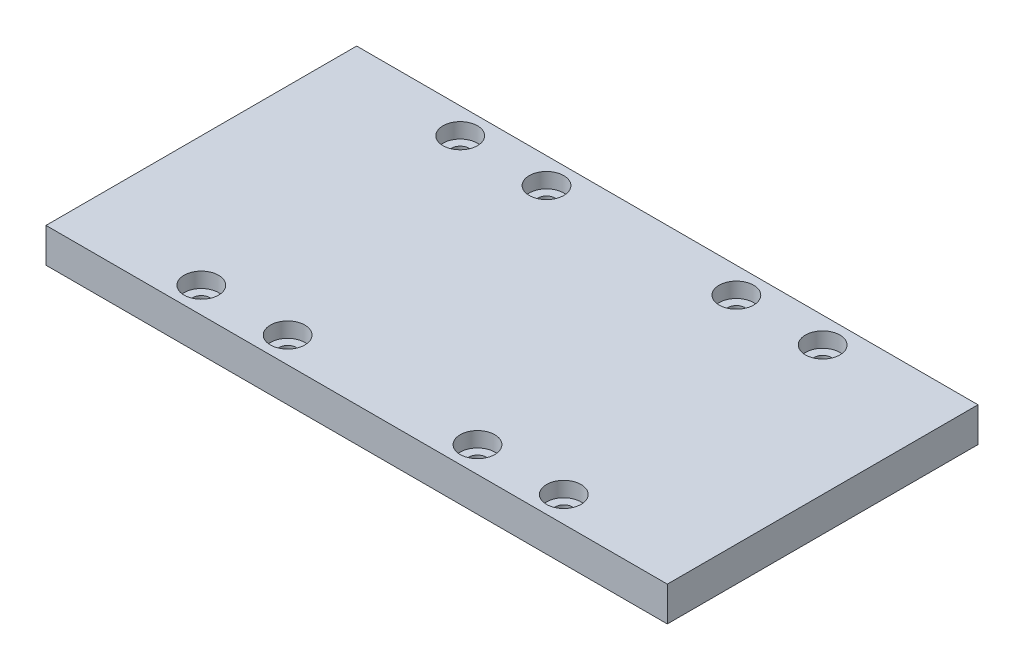
ISO-10303-21;
HEADER;
FILE_DESCRIPTION(('STEP AP214'),'2;1');
FILE_NAME('part.step','',(''),(''),'','','');
FILE_SCHEMA(('AUTOMOTIVE_DESIGN { 1 0 10303 214 1 1 1 1 }'));
ENDSEC;
DATA;
#1=APPLICATION_CONTEXT('core data for automotive mechanical design processes');
#2=APPLICATION_PROTOCOL_DEFINITION('international standard','automotive_design',2000,#1);
#3=PRODUCT_CONTEXT('',#1,'mechanical');
#4=PRODUCT('Part','Part','',(#3));
#5=PRODUCT_RELATED_PRODUCT_CATEGORY('part','',(#4));
#6=PRODUCT_DEFINITION_FORMATION('','',#4);
#7=PRODUCT_DEFINITION_CONTEXT('part definition',#1,'design');
#8=PRODUCT_DEFINITION('design','',#6,#7);
#9=PRODUCT_DEFINITION_SHAPE('','',#8);
#10=(LENGTH_UNIT() NAMED_UNIT(*) SI_UNIT(.MILLI.,.METRE.));
#11=(NAMED_UNIT(*) PLANE_ANGLE_UNIT() SI_UNIT($,.RADIAN.));
#12=(NAMED_UNIT(*) SI_UNIT($,.STERADIAN.) SOLID_ANGLE_UNIT());
#13=UNCERTAINTY_MEASURE_WITH_UNIT(LENGTH_MEASURE(1.E-05),#10,'distance_accuracy_value','');
#14=(GEOMETRIC_REPRESENTATION_CONTEXT(3) GLOBAL_UNCERTAINTY_ASSIGNED_CONTEXT((#13)) GLOBAL_UNIT_ASSIGNED_CONTEXT((#10,
#11,#12)) REPRESENTATION_CONTEXT('',''));
#15=CARTESIAN_POINT('',(0.,0.,0.));
#16=DIRECTION('',(0.,0.,1.));
#17=DIRECTION('',(1.,0.,0.));
#18=AXIS2_PLACEMENT_3D('',#15,#16,#17);
#19=CARTESIAN_POINT('',(180.975,311.912,-9.525));
#20=DIRECTION('',(0.,-1.,0.));
#21=DIRECTION('',(0.,0.,-1.));
#22=AXIS2_PLACEMENT_3D('',#19,#20,#21);
#23=CYLINDRICAL_SURFACE('',#22,3.175);
#24=CARTESIAN_POINT('',(180.975,0.,-9.525));
#25=DIRECTION('',(0.,-1.,0.));
#26=DIRECTION('',(0.,0.,-1.));
#27=AXIS2_PLACEMENT_3D('',#24,#25,#26);
#28=CIRCLE('',#27,3.175);
#29=CARTESIAN_POINT('',(180.975,0.,-12.7));
#30=VERTEX_POINT('',#29);
#31=EDGE_CURVE('E188',#30,#30,#28,.T.);
#32=ORIENTED_EDGE('',*,*,#31,.T.);
#33=EDGE_LOOP('',(#32));
#34=FACE_BOUND('',#33,.T.);
#35=CARTESIAN_POINT('',(180.975,7.14375,-9.525));
#36=DIRECTION('',(0.,1.,0.));
#37=DIRECTION('',(0.,0.,1.));
#38=AXIS2_PLACEMENT_3D('',#35,#36,#37);
#39=CIRCLE('',#38,3.175);
#40=CARTESIAN_POINT('',(180.975,7.14375,-6.35));
#41=VERTEX_POINT('',#40);
#42=EDGE_CURVE('E35',#41,#41,#39,.F.);
#43=ORIENTED_EDGE('',*,*,#42,.F.);
#44=EDGE_LOOP('',(#43));
#45=FACE_BOUND('',#44,.T.);
#46=ADVANCED_FACE('F31',(#34,#45),#23,.F.);
#47=CARTESIAN_POINT('',(149.225,311.912,-9.525));
#48=DIRECTION('',(0.,-1.,0.));
#49=DIRECTION('',(0.,0.,-1.));
#50=AXIS2_PLACEMENT_3D('',#47,#48,#49);
#51=CYLINDRICAL_SURFACE('',#50,3.175);
#52=CARTESIAN_POINT('',(149.225,0.,-9.525));
#53=DIRECTION('',(0.,-1.,0.));
#54=DIRECTION('',(0.,0.,-1.));
#55=AXIS2_PLACEMENT_3D('',#52,#53,#54);
#56=CIRCLE('',#55,3.175);
#57=CARTESIAN_POINT('',(149.225,0.,-12.7));
#58=VERTEX_POINT('',#57);
#59=EDGE_CURVE('E191',#58,#58,#56,.T.);
#60=ORIENTED_EDGE('',*,*,#59,.T.);
#61=EDGE_LOOP('',(#60));
#62=FACE_BOUND('',#61,.T.);
#63=CARTESIAN_POINT('',(149.225,7.14375,-9.525));
#64=DIRECTION('',(0.,1.,0.));
#65=DIRECTION('',(0.,0.,1.));
#66=AXIS2_PLACEMENT_3D('',#63,#64,#65);
#67=CIRCLE('',#66,3.175);
#68=CARTESIAN_POINT('',(149.225,7.14375,-6.35));
#69=VERTEX_POINT('',#68);
#70=EDGE_CURVE('E136',#69,#69,#67,.F.);
#71=ORIENTED_EDGE('',*,*,#70,.F.);
#72=EDGE_LOOP('',(#71));
#73=FACE_BOUND('',#72,.T.);
#74=ADVANCED_FACE('F222',(#62,#73),#51,.F.);
#75=CARTESIAN_POINT('',(79.375,311.912,-9.525));
#76=DIRECTION('',(0.,-1.,0.));
#77=DIRECTION('',(0.,0.,-1.));
#78=AXIS2_PLACEMENT_3D('',#75,#76,#77);
#79=CYLINDRICAL_SURFACE('',#78,3.175);
#80=CARTESIAN_POINT('',(79.375,0.,-9.525));
#81=DIRECTION('',(0.,-1.,0.));
#82=DIRECTION('',(0.,0.,-1.));
#83=AXIS2_PLACEMENT_3D('',#80,#81,#82);
#84=CIRCLE('',#83,3.175);
#85=CARTESIAN_POINT('',(79.375,0.,-12.7));
#86=VERTEX_POINT('',#85);
#87=EDGE_CURVE('E194',#86,#86,#84,.T.);
#88=ORIENTED_EDGE('',*,*,#87,.T.);
#89=EDGE_LOOP('',(#88));
#90=FACE_BOUND('',#89,.T.);
#91=CARTESIAN_POINT('',(79.375,7.14375,-9.525));
#92=DIRECTION('',(0.,1.,0.));
#93=DIRECTION('',(0.,0.,1.));
#94=AXIS2_PLACEMENT_3D('',#91,#92,#93);
#95=CIRCLE('',#94,3.175);
#96=CARTESIAN_POINT('',(79.375,7.14375,-6.35));
#97=VERTEX_POINT('',#96);
#98=EDGE_CURVE('E132',#97,#97,#95,.F.);
#99=ORIENTED_EDGE('',*,*,#98,.F.);
#100=EDGE_LOOP('',(#99));
#101=FACE_BOUND('',#100,.T.);
#102=ADVANCED_FACE('F228',(#90,#101),#79,.F.);
#103=CARTESIAN_POINT('',(47.625,311.912,-9.525));
#104=DIRECTION('',(0.,-1.,0.));
#105=DIRECTION('',(0.,0.,-1.));
#106=AXIS2_PLACEMENT_3D('',#103,#104,#105);
#107=CYLINDRICAL_SURFACE('',#106,3.175);
#108=CARTESIAN_POINT('',(47.625,0.,-9.525));
#109=DIRECTION('',(0.,-1.,0.));
#110=DIRECTION('',(0.,0.,-1.));
#111=AXIS2_PLACEMENT_3D('',#108,#109,#110);
#112=CIRCLE('',#111,3.175);
#113=CARTESIAN_POINT('',(47.625,0.,-12.7));
#114=VERTEX_POINT('',#113);
#115=EDGE_CURVE('E101',#114,#114,#112,.T.);
#116=ORIENTED_EDGE('',*,*,#115,.T.);
#117=EDGE_LOOP('',(#116));
#118=FACE_BOUND('',#117,.T.);
#119=CARTESIAN_POINT('',(47.625,7.14375,-9.525));
#120=DIRECTION('',(0.,1.,0.));
#121=DIRECTION('',(0.,0.,1.));
#122=AXIS2_PLACEMENT_3D('',#119,#120,#121);
#123=CIRCLE('',#122,3.175);
#124=CARTESIAN_POINT('',(47.625,7.14375,-6.35));
#125=VERTEX_POINT('',#124);
#126=EDGE_CURVE('E127',#125,#125,#123,.F.);
#127=ORIENTED_EDGE('',*,*,#126,.F.);
#128=EDGE_LOOP('',(#127));
#129=FACE_BOUND('',#128,.T.);
#130=ADVANCED_FACE('F200',(#118,#129),#107,.F.);
#131=CARTESIAN_POINT('',(180.975000000001,311.912,-104.775));
#132=DIRECTION('',(0.,-1.,0.));
#133=DIRECTION('',(0.,0.,-1.));
#134=AXIS2_PLACEMENT_3D('',#131,#132,#133);
#135=CYLINDRICAL_SURFACE('',#134,3.175);
#136=CARTESIAN_POINT('',(180.975000000001,0.,-104.775));
#137=DIRECTION('',(0.,-1.,0.));
#138=DIRECTION('',(0.,0.,-1.));
#139=AXIS2_PLACEMENT_3D('',#136,#137,#138);
#140=CIRCLE('',#139,3.175);
#141=CARTESIAN_POINT('',(180.975000000001,0.,-107.95));
#142=VERTEX_POINT('',#141);
#143=EDGE_CURVE('E110',#142,#142,#140,.T.);
#144=ORIENTED_EDGE('',*,*,#143,.T.);
#145=EDGE_LOOP('',(#144));
#146=FACE_BOUND('',#145,.T.);
#147=CARTESIAN_POINT('',(180.975000000001,7.14375,-104.775));
#148=DIRECTION('',(0.,1.,0.));
#149=DIRECTION('',(0.,0.,1.));
#150=AXIS2_PLACEMENT_3D('',#147,#148,#149);
#151=CIRCLE('',#150,3.175);
#152=CARTESIAN_POINT('',(180.975000000001,7.14375,-101.6));
#153=VERTEX_POINT('',#152);
#154=EDGE_CURVE('E122',#153,#153,#151,.F.);
#155=ORIENTED_EDGE('',*,*,#154,.F.);
#156=EDGE_LOOP('',(#155));
#157=FACE_BOUND('',#156,.T.);
#158=ADVANCED_FACE('F240',(#146,#157),#135,.F.);
#159=CARTESIAN_POINT('',(149.225000000001,311.912,-104.775));
#160=DIRECTION('',(0.,-1.,0.));
#161=DIRECTION('',(0.,0.,-1.));
#162=AXIS2_PLACEMENT_3D('',#159,#160,#161);
#163=CYLINDRICAL_SURFACE('',#162,3.175);
#164=CARTESIAN_POINT('',(149.225000000001,0.,-104.775));
#165=DIRECTION('',(0.,-1.,0.));
#166=DIRECTION('',(0.,0.,-1.));
#167=AXIS2_PLACEMENT_3D('',#164,#165,#166);
#168=CIRCLE('',#167,3.175);
#169=CARTESIAN_POINT('',(149.225000000001,0.,-107.95));
#170=VERTEX_POINT('',#169);
#171=EDGE_CURVE('E179',#170,#170,#168,.T.);
#172=ORIENTED_EDGE('',*,*,#171,.T.);
#173=EDGE_LOOP('',(#172));
#174=FACE_BOUND('',#173,.T.);
#175=CARTESIAN_POINT('',(149.225000000001,7.14375,-104.775));
#176=DIRECTION('',(0.,1.,0.));
#177=DIRECTION('',(0.,0.,1.));
#178=AXIS2_PLACEMENT_3D('',#175,#176,#177);
#179=CIRCLE('',#178,3.175);
#180=CARTESIAN_POINT('',(149.225000000001,7.14375,-101.6));
#181=VERTEX_POINT('',#180);
#182=EDGE_CURVE('E117',#181,#181,#179,.F.);
#183=ORIENTED_EDGE('',*,*,#182,.F.);
#184=EDGE_LOOP('',(#183));
#185=FACE_BOUND('',#184,.T.);
#186=ADVANCED_FACE('F244',(#174,#185),#163,.F.);
#187=CARTESIAN_POINT('',(79.375000000001,311.912,-104.775));
#188=DIRECTION('',(0.,-1.,0.));
#189=DIRECTION('',(0.,0.,-1.));
#190=AXIS2_PLACEMENT_3D('',#187,#188,#189);
#191=CYLINDRICAL_SURFACE('',#190,3.175);
#192=CARTESIAN_POINT('',(79.375000000001,0.,-104.775));
#193=DIRECTION('',(0.,-1.,0.));
#194=DIRECTION('',(0.,0.,-1.));
#195=AXIS2_PLACEMENT_3D('',#192,#193,#194);
#196=CIRCLE('',#195,3.175);
#197=CARTESIAN_POINT('',(79.375000000001,0.,-107.95));
#198=VERTEX_POINT('',#197);
#199=EDGE_CURVE('E182',#198,#198,#196,.T.);
#200=ORIENTED_EDGE('',*,*,#199,.T.);
#201=EDGE_LOOP('',(#200));
#202=FACE_BOUND('',#201,.T.);
#203=CARTESIAN_POINT('',(79.375000000001,7.14375,-104.775));
#204=DIRECTION('',(0.,1.,0.));
#205=DIRECTION('',(0.,0.,1.));
#206=AXIS2_PLACEMENT_3D('',#203,#204,#205);
#207=CIRCLE('',#206,3.175);
#208=CARTESIAN_POINT('',(79.375000000001,7.14375,-101.6));
#209=VERTEX_POINT('',#208);
#210=EDGE_CURVE('E112',#209,#209,#207,.F.);
#211=ORIENTED_EDGE('',*,*,#210,.F.);
#212=EDGE_LOOP('',(#211));
#213=FACE_BOUND('',#212,.T.);
#214=ADVANCED_FACE('F250',(#202,#213),#191,.F.);
#215=CARTESIAN_POINT('',(47.625000000001,311.912,-104.775));
#216=DIRECTION('',(0.,-1.,0.));
#217=DIRECTION('',(0.,0.,-1.));
#218=AXIS2_PLACEMENT_3D('',#215,#216,#217);
#219=CYLINDRICAL_SURFACE('',#218,3.175);
#220=CARTESIAN_POINT('',(47.625000000001,0.,-104.775));
#221=DIRECTION('',(0.,-1.,0.));
#222=DIRECTION('',(0.,0.,-1.));
#223=AXIS2_PLACEMENT_3D('',#220,#221,#222);
#224=CIRCLE('',#223,3.175);
#225=CARTESIAN_POINT('',(47.625000000001,0.,-107.95));
#226=VERTEX_POINT('',#225);
#227=EDGE_CURVE('E185',#226,#226,#224,.T.);
#228=ORIENTED_EDGE('',*,*,#227,.T.);
#229=EDGE_LOOP('',(#228));
#230=FACE_BOUND('',#229,.T.);
#231=CARTESIAN_POINT('',(47.625000000001,7.14375,-104.775));
#232=DIRECTION('',(0.,1.,0.));
#233=DIRECTION('',(0.,0.,1.));
#234=AXIS2_PLACEMENT_3D('',#231,#232,#233);
#235=CIRCLE('',#234,3.175);
#236=CARTESIAN_POINT('',(47.625000000001,7.14375,-101.6));
#237=VERTEX_POINT('',#236);
#238=EDGE_CURVE('E107',#237,#237,#235,.F.);
#239=ORIENTED_EDGE('',*,*,#238,.F.);
#240=EDGE_LOOP('',(#239));
#241=FACE_BOUND('',#240,.T.);
#242=ADVANCED_FACE('F233',(#230,#241),#219,.F.);
#243=CARTESIAN_POINT('',(0.,12.7,0.));
#244=DIRECTION('',(1.,0.,0.));
#245=DIRECTION('',(0.,0.,-1.));
#246=AXIS2_PLACEMENT_3D('',#243,#244,#245);
#247=PLANE('',#246);
#248=DIRECTION('',(0.,0.,1.));
#249=VECTOR('',#248,1.);
#250=CARTESIAN_POINT('',(0.,0.,0.));
#251=LINE('',#250,#249);
#252=CARTESIAN_POINT('',(0.,0.,-114.3));
#253=VERTEX_POINT('',#252);
#254=CARTESIAN_POINT('',(0.,0.,0.));
#255=VERTEX_POINT('',#254);
#256=EDGE_CURVE('E98',#253,#255,#251,.T.);
#257=ORIENTED_EDGE('',*,*,#256,.T.);
#258=DIRECTION('',(0.,-1.,0.));
#259=VECTOR('',#258,1.);
#260=CARTESIAN_POINT('',(0.,12.7,0.));
#261=LINE('',#260,#259);
#262=CARTESIAN_POINT('',(0.,12.7,0.));
#263=VERTEX_POINT('',#262);
#264=EDGE_CURVE('E11',#263,#255,#261,.T.);
#265=ORIENTED_EDGE('',*,*,#264,.F.);
#266=DIRECTION('',(0.,0.,1.));
#267=VECTOR('',#266,1.);
#268=CARTESIAN_POINT('',(0.,12.7,0.));
#269=LINE('',#268,#267);
#270=CARTESIAN_POINT('',(0.,12.7,-114.3));
#271=VERTEX_POINT('',#270);
#272=EDGE_CURVE('E85',#271,#263,#269,.T.);
#273=ORIENTED_EDGE('',*,*,#272,.F.);
#274=DIRECTION('',(0.,-1.,0.));
#275=VECTOR('',#274,1.);
#276=CARTESIAN_POINT('',(0.,12.7,-114.3));
#277=LINE('',#276,#275);
#278=EDGE_CURVE('E94',#271,#253,#277,.T.);
#279=ORIENTED_EDGE('',*,*,#278,.T.);
#280=EDGE_LOOP('',(#257,#265,#273,#279));
#281=FACE_BOUND('',#280,.T.);
#282=ADVANCED_FACE('F33',(#281),#247,.F.);
#283=CARTESIAN_POINT('',(0.,12.7,0.));
#284=DIRECTION('',(0.,0.,-1.));
#285=DIRECTION('',(-1.,0.,0.));
#286=AXIS2_PLACEMENT_3D('',#283,#284,#285);
#287=PLANE('',#286);
#288=DIRECTION('',(1.,0.,0.));
#289=VECTOR('',#288,1.);
#290=CARTESIAN_POINT('',(0.,0.,0.));
#291=LINE('',#290,#289);
#292=CARTESIAN_POINT('',(228.6,0.,0.));
#293=VERTEX_POINT('',#292);
#294=EDGE_CURVE('E89',#255,#293,#291,.T.);
#295=ORIENTED_EDGE('',*,*,#294,.T.);
#296=DIRECTION('',(0.,-1.,0.));
#297=VECTOR('',#296,1.);
#298=CARTESIAN_POINT('',(228.6,12.7,0.));
#299=LINE('',#298,#297);
#300=CARTESIAN_POINT('',(228.6,12.7,0.));
#301=VERTEX_POINT('',#300);
#302=EDGE_CURVE('E41',#301,#293,#299,.T.);
#303=ORIENTED_EDGE('',*,*,#302,.F.);
#304=DIRECTION('',(1.,0.,0.));
#305=VECTOR('',#304,1.);
#306=CARTESIAN_POINT('',(0.,12.7,0.));
#307=LINE('',#306,#305);
#308=EDGE_CURVE('E80',#263,#301,#307,.T.);
#309=ORIENTED_EDGE('',*,*,#308,.F.);
#310=ORIENTED_EDGE('',*,*,#264,.T.);
#311=EDGE_LOOP('',(#295,#303,#309,#310));
#312=FACE_BOUND('',#311,.T.);
#313=ADVANCED_FACE('F88',(#312),#287,.F.);
#314=CARTESIAN_POINT('',(228.6,12.7,0.));
#315=DIRECTION('',(-1.,0.,0.));
#316=DIRECTION('',(0.,0.,1.));
#317=AXIS2_PLACEMENT_3D('',#314,#315,#316);
#318=PLANE('',#317);
#319=DIRECTION('',(0.,0.,-1.));
#320=VECTOR('',#319,1.);
#321=CARTESIAN_POINT('',(228.6,0.,0.));
#322=LINE('',#321,#320);
#323=CARTESIAN_POINT('',(228.6,0.,-114.3));
#324=VERTEX_POINT('',#323);
#325=EDGE_CURVE('E67',#293,#324,#322,.T.);
#326=ORIENTED_EDGE('',*,*,#325,.T.);
#327=DIRECTION('',(0.,-1.,0.));
#328=VECTOR('',#327,1.);
#329=CARTESIAN_POINT('',(228.6,12.7,-114.3));
#330=LINE('',#329,#328);
#331=CARTESIAN_POINT('',(228.6,12.7,-114.3));
#332=VERTEX_POINT('',#331);
#333=EDGE_CURVE('E90',#332,#324,#330,.T.);
#334=ORIENTED_EDGE('',*,*,#333,.F.);
#335=DIRECTION('',(0.,0.,-1.));
#336=VECTOR('',#335,1.);
#337=CARTESIAN_POINT('',(228.6,12.7,0.));
#338=LINE('',#337,#336);
#339=EDGE_CURVE('E83',#301,#332,#338,.T.);
#340=ORIENTED_EDGE('',*,*,#339,.F.);
#341=ORIENTED_EDGE('',*,*,#302,.T.);
#342=EDGE_LOOP('',(#326,#334,#340,#341));
#343=FACE_BOUND('',#342,.T.);
#344=ADVANCED_FACE('F92',(#343),#318,.F.);
#345=CARTESIAN_POINT('',(0.,12.7,-114.3));
#346=DIRECTION('',(0.,0.,1.));
#347=DIRECTION('',(1.,0.,0.));
#348=AXIS2_PLACEMENT_3D('',#345,#346,#347);
#349=PLANE('',#348);
#350=DIRECTION('',(-1.,0.,0.));
#351=VECTOR('',#350,1.);
#352=CARTESIAN_POINT('',(0.,0.,-114.3));
#353=LINE('',#352,#351);
#354=EDGE_CURVE('E73',#324,#253,#353,.T.);
#355=ORIENTED_EDGE('',*,*,#354,.T.);
#356=ORIENTED_EDGE('',*,*,#278,.F.);
#357=DIRECTION('',(-1.,0.,0.));
#358=VECTOR('',#357,1.);
#359=CARTESIAN_POINT('',(0.,12.7,-114.3));
#360=LINE('',#359,#358);
#361=EDGE_CURVE('E50',#332,#271,#360,.T.);
#362=ORIENTED_EDGE('',*,*,#361,.F.);
#363=ORIENTED_EDGE('',*,*,#333,.T.);
#364=EDGE_LOOP('',(#355,#356,#362,#363));
#365=FACE_BOUND('',#364,.T.);
#366=ADVANCED_FACE('F211',(#365),#349,.F.);
#367=CARTESIAN_POINT('',(0.,12.7,-114.3));
#368=DIRECTION('',(0.,-1.,0.));
#369=DIRECTION('',(0.,0.,-1.));
#370=AXIS2_PLACEMENT_3D('',#367,#368,#369);
#371=PLANE('',#370);
#372=CARTESIAN_POINT('',(180.975000000002,12.7,-9.52500000000001));
#373=DIRECTION('',(0.,1.,0.));
#374=DIRECTION('',(0.,0.,1.));
#375=AXIS2_PLACEMENT_3D('',#372,#373,#374);
#376=CIRCLE('',#375,6.35000000000101);
#377=CARTESIAN_POINT('',(180.975000000002,12.7,-3.17499999999899));
#378=VERTEX_POINT('',#377);
#379=EDGE_CURVE('E152',#378,#378,#376,.T.);
#380=ORIENTED_EDGE('',*,*,#379,.F.);
#381=EDGE_LOOP('',(#380));
#382=FACE_BOUND('',#381,.T.);
#383=CARTESIAN_POINT('',(149.225000000002,12.7,-9.52500000000001));
#384=DIRECTION('',(0.,1.,0.));
#385=DIRECTION('',(0.,0.,1.));
#386=AXIS2_PLACEMENT_3D('',#383,#384,#385);
#387=CIRCLE('',#386,6.35000000000099);
#388=CARTESIAN_POINT('',(149.225000000002,12.7,-3.17499999999902));
#389=VERTEX_POINT('',#388);
#390=EDGE_CURVE('E145',#389,#389,#387,.T.);
#391=ORIENTED_EDGE('',*,*,#390,.F.);
#392=EDGE_LOOP('',(#391));
#393=FACE_BOUND('',#392,.T.);
#394=CARTESIAN_POINT('',(79.375000000002,12.7,-9.52500000000001));
#395=DIRECTION('',(0.,1.,0.));
#396=DIRECTION('',(0.,0.,1.));
#397=AXIS2_PLACEMENT_3D('',#394,#395,#396);
#398=CIRCLE('',#397,6.35000000000101);
#399=CARTESIAN_POINT('',(79.375000000002,12.7,-3.17499999999899));
#400=VERTEX_POINT('',#399);
#401=EDGE_CURVE('E138',#400,#400,#398,.T.);
#402=ORIENTED_EDGE('',*,*,#401,.F.);
#403=EDGE_LOOP('',(#402));
#404=FACE_BOUND('',#403,.T.);
#405=CARTESIAN_POINT('',(47.625000000002,12.7,-9.52500000000001));
#406=DIRECTION('',(0.,1.,0.));
#407=DIRECTION('',(0.,0.,1.));
#408=AXIS2_PLACEMENT_3D('',#405,#406,#407);
#409=CIRCLE('',#408,6.350000000001);
#410=CARTESIAN_POINT('',(47.625000000002,12.7,-3.17499999999901));
#411=VERTEX_POINT('',#410);
#412=EDGE_CURVE('E134',#411,#411,#409,.T.);
#413=ORIENTED_EDGE('',*,*,#412,.F.);
#414=EDGE_LOOP('',(#413));
#415=FACE_BOUND('',#414,.T.);
#416=CARTESIAN_POINT('',(180.975000000001,12.7,-104.775));
#417=DIRECTION('',(0.,1.,0.));
#418=DIRECTION('',(0.,0.,1.));
#419=AXIS2_PLACEMENT_3D('',#416,#417,#418);
#420=CIRCLE('',#419,6.35000000000101);
#421=CARTESIAN_POINT('',(180.975000000001,12.7,-98.424999999999));
#422=VERTEX_POINT('',#421);
#423=EDGE_CURVE('E130',#422,#422,#420,.T.);
#424=ORIENTED_EDGE('',*,*,#423,.F.);
#425=EDGE_LOOP('',(#424));
#426=FACE_BOUND('',#425,.T.);
#427=CARTESIAN_POINT('',(149.225000000001,12.7,-104.775));
#428=DIRECTION('',(0.,1.,0.));
#429=DIRECTION('',(0.,0.,1.));
#430=AXIS2_PLACEMENT_3D('',#427,#428,#429);
#431=CIRCLE('',#430,6.35000000000099);
#432=CARTESIAN_POINT('',(149.225000000001,12.7,-98.424999999999));
#433=VERTEX_POINT('',#432);
#434=EDGE_CURVE('E125',#433,#433,#431,.T.);
#435=ORIENTED_EDGE('',*,*,#434,.F.);
#436=EDGE_LOOP('',(#435));
#437=FACE_BOUND('',#436,.T.);
#438=CARTESIAN_POINT('',(79.375000000001,12.7,-104.775));
#439=DIRECTION('',(0.,1.,0.));
#440=DIRECTION('',(0.,0.,1.));
#441=AXIS2_PLACEMENT_3D('',#438,#439,#440);
#442=CIRCLE('',#441,6.35000000000101);
#443=CARTESIAN_POINT('',(79.375000000001,12.7,-98.424999999999));
#444=VERTEX_POINT('',#443);
#445=EDGE_CURVE('E120',#444,#444,#442,.T.);
#446=ORIENTED_EDGE('',*,*,#445,.F.);
#447=EDGE_LOOP('',(#446));
#448=FACE_BOUND('',#447,.T.);
#449=CARTESIAN_POINT('',(47.625000000001,12.7,-104.775));
#450=DIRECTION('',(0.,1.,0.));
#451=DIRECTION('',(0.,0.,1.));
#452=AXIS2_PLACEMENT_3D('',#449,#450,#451);
#453=CIRCLE('',#452,6.350000000001);
#454=CARTESIAN_POINT('',(47.625000000001,12.7,-98.424999999999));
#455=VERTEX_POINT('',#454);
#456=EDGE_CURVE('E115',#455,#455,#453,.T.);
#457=ORIENTED_EDGE('',*,*,#456,.F.);
#458=EDGE_LOOP('',(#457));
#459=FACE_BOUND('',#458,.T.);
#460=ORIENTED_EDGE('',*,*,#272,.T.);
#461=ORIENTED_EDGE('',*,*,#308,.T.);
#462=ORIENTED_EDGE('',*,*,#339,.T.);
#463=ORIENTED_EDGE('',*,*,#361,.T.);
#464=EDGE_LOOP('',(#460,#461,#462,#463));
#465=FACE_BOUND('',#464,.T.);
#466=ADVANCED_FACE('F81',(#382,#393,#404,#415,#426,#437,#448,#459,#465),#371,.F.);
#467=CARTESIAN_POINT('',(0.,0.,-114.3));
#468=DIRECTION('',(0.,-1.,0.));
#469=DIRECTION('',(0.,0.,-1.));
#470=AXIS2_PLACEMENT_3D('',#467,#468,#469);
#471=PLANE('',#470);
#472=ORIENTED_EDGE('',*,*,#143,.F.);
#473=EDGE_LOOP('',(#472));
#474=FACE_BOUND('',#473,.T.);
#475=ORIENTED_EDGE('',*,*,#171,.F.);
#476=EDGE_LOOP('',(#475));
#477=FACE_BOUND('',#476,.T.);
#478=ORIENTED_EDGE('',*,*,#199,.F.);
#479=EDGE_LOOP('',(#478));
#480=FACE_BOUND('',#479,.T.);
#481=ORIENTED_EDGE('',*,*,#227,.F.);
#482=EDGE_LOOP('',(#481));
#483=FACE_BOUND('',#482,.T.);
#484=ORIENTED_EDGE('',*,*,#31,.F.);
#485=EDGE_LOOP('',(#484));
#486=FACE_BOUND('',#485,.T.);
#487=ORIENTED_EDGE('',*,*,#59,.F.);
#488=EDGE_LOOP('',(#487));
#489=FACE_BOUND('',#488,.T.);
#490=ORIENTED_EDGE('',*,*,#87,.F.);
#491=EDGE_LOOP('',(#490));
#492=FACE_BOUND('',#491,.T.);
#493=ORIENTED_EDGE('',*,*,#115,.F.);
#494=EDGE_LOOP('',(#493));
#495=FACE_BOUND('',#494,.T.);
#496=ORIENTED_EDGE('',*,*,#256,.F.);
#497=ORIENTED_EDGE('',*,*,#354,.F.);
#498=ORIENTED_EDGE('',*,*,#325,.F.);
#499=ORIENTED_EDGE('',*,*,#294,.F.);
#500=EDGE_LOOP('',(#496,#497,#498,#499));
#501=FACE_BOUND('',#500,.T.);
#502=ADVANCED_FACE('F203',(#474,#477,#480,#483,#486,#489,#492,#495,#501),#471,.T.);
#503=CARTESIAN_POINT('',(47.625000000001,7.14375,-104.775));
#504=DIRECTION('',(0.,1.,0.));
#505=DIRECTION('',(0.,0.,1.));
#506=AXIS2_PLACEMENT_3D('',#503,#504,#505);
#507=PLANE('',#506);
#508=CARTESIAN_POINT('',(47.625000000001,7.14375,-104.775));
#509=DIRECTION('',(0.,1.,0.));
#510=DIRECTION('',(0.,0.,1.));
#511=AXIS2_PLACEMENT_3D('',#508,#509,#510);
#512=CIRCLE('',#511,6.350000000001);
#513=CARTESIAN_POINT('',(47.625000000001,7.14375,-98.424999999999));
#514=VERTEX_POINT('',#513);
#515=EDGE_CURVE('E111',#514,#514,#512,.T.);
#516=ORIENTED_EDGE('',*,*,#515,.T.);
#517=EDGE_LOOP('',(#516));
#518=FACE_BOUND('',#517,.T.);
#519=ORIENTED_EDGE('',*,*,#238,.T.);
#520=EDGE_LOOP('',(#519));
#521=FACE_BOUND('',#520,.T.);
#522=ADVANCED_FACE('F206',(#518,#521),#507,.T.);
#523=CARTESIAN_POINT('',(47.625000000001,7.14375,-104.775));
#524=DIRECTION('',(0.,1.,0.));
#525=DIRECTION('',(0.,0.,1.));
#526=AXIS2_PLACEMENT_3D('',#523,#524,#525);
#527=CYLINDRICAL_SURFACE('',#526,6.350000000001);
#528=ORIENTED_EDGE('',*,*,#515,.F.);
#529=EDGE_LOOP('',(#528));
#530=FACE_BOUND('',#529,.T.);
#531=ORIENTED_EDGE('',*,*,#456,.T.);
#532=EDGE_LOOP('',(#531));
#533=FACE_BOUND('',#532,.T.);
#534=ADVANCED_FACE('F255',(#530,#533),#527,.F.);
#535=CARTESIAN_POINT('',(79.375000000001,7.14375,-104.775));
#536=DIRECTION('',(0.,1.,0.));
#537=DIRECTION('',(0.,0.,1.));
#538=AXIS2_PLACEMENT_3D('',#535,#536,#537);
#539=PLANE('',#538);
#540=CARTESIAN_POINT('',(79.375000000001,7.14375,-104.775));
#541=DIRECTION('',(0.,1.,0.));
#542=DIRECTION('',(0.,0.,1.));
#543=AXIS2_PLACEMENT_3D('',#540,#541,#542);
#544=CIRCLE('',#543,6.35000000000101);
#545=CARTESIAN_POINT('',(79.375000000001,7.14375,-98.424999999999));
#546=VERTEX_POINT('',#545);
#547=EDGE_CURVE('E116',#546,#546,#544,.T.);
#548=ORIENTED_EDGE('',*,*,#547,.T.);
#549=EDGE_LOOP('',(#548));
#550=FACE_BOUND('',#549,.T.);
#551=ORIENTED_EDGE('',*,*,#210,.T.);
#552=EDGE_LOOP('',(#551));
#553=FACE_BOUND('',#552,.T.);
#554=ADVANCED_FACE('F267',(#550,#553),#539,.T.);
#555=CARTESIAN_POINT('',(79.375000000001,7.14375,-104.775));
#556=DIRECTION('',(0.,1.,0.));
#557=DIRECTION('',(0.,0.,1.));
#558=AXIS2_PLACEMENT_3D('',#555,#556,#557);
#559=CYLINDRICAL_SURFACE('',#558,6.35000000000101);
#560=ORIENTED_EDGE('',*,*,#547,.F.);
#561=EDGE_LOOP('',(#560));
#562=FACE_BOUND('',#561,.T.);
#563=ORIENTED_EDGE('',*,*,#445,.T.);
#564=EDGE_LOOP('',(#563));
#565=FACE_BOUND('',#564,.T.);
#566=ADVANCED_FACE('F269',(#562,#565),#559,.F.);
#567=CARTESIAN_POINT('',(149.225000000001,7.14375,-104.775));
#568=DIRECTION('',(0.,1.,0.));
#569=DIRECTION('',(0.,0.,1.));
#570=AXIS2_PLACEMENT_3D('',#567,#568,#569);
#571=PLANE('',#570);
#572=CARTESIAN_POINT('',(149.225000000001,7.14375,-104.775));
#573=DIRECTION('',(0.,1.,0.));
#574=DIRECTION('',(0.,0.,1.));
#575=AXIS2_PLACEMENT_3D('',#572,#573,#574);
#576=CIRCLE('',#575,6.35000000000099);
#577=CARTESIAN_POINT('',(149.225000000001,7.14375,-98.424999999999));
#578=VERTEX_POINT('',#577);
#579=EDGE_CURVE('E121',#578,#578,#576,.T.);
#580=ORIENTED_EDGE('',*,*,#579,.T.);
#581=EDGE_LOOP('',(#580));
#582=FACE_BOUND('',#581,.T.);
#583=ORIENTED_EDGE('',*,*,#182,.T.);
#584=EDGE_LOOP('',(#583));
#585=FACE_BOUND('',#584,.T.);
#586=ADVANCED_FACE('F276',(#582,#585),#571,.T.);
#587=CARTESIAN_POINT('',(149.225000000001,7.14375,-104.775));
#588=DIRECTION('',(0.,1.,0.));
#589=DIRECTION('',(0.,0.,1.));
#590=AXIS2_PLACEMENT_3D('',#587,#588,#589);
#591=CYLINDRICAL_SURFACE('',#590,6.35000000000099);
#592=ORIENTED_EDGE('',*,*,#579,.F.);
#593=EDGE_LOOP('',(#592));
#594=FACE_BOUND('',#593,.T.);
#595=ORIENTED_EDGE('',*,*,#434,.T.);
#596=EDGE_LOOP('',(#595));
#597=FACE_BOUND('',#596,.T.);
#598=ADVANCED_FACE('F281',(#594,#597),#591,.F.);
#599=CARTESIAN_POINT('',(180.975000000001,7.14375,-104.775));
#600=DIRECTION('',(0.,1.,0.));
#601=DIRECTION('',(0.,0.,1.));
#602=AXIS2_PLACEMENT_3D('',#599,#600,#601);
#603=PLANE('',#602);
#604=CARTESIAN_POINT('',(180.975000000001,7.14375,-104.775));
#605=DIRECTION('',(0.,1.,0.));
#606=DIRECTION('',(0.,0.,1.));
#607=AXIS2_PLACEMENT_3D('',#604,#605,#606);
#608=CIRCLE('',#607,6.35000000000101);
#609=CARTESIAN_POINT('',(180.975000000001,7.14375,-98.424999999999));
#610=VERTEX_POINT('',#609);
#611=EDGE_CURVE('E126',#610,#610,#608,.T.);
#612=ORIENTED_EDGE('',*,*,#611,.T.);
#613=EDGE_LOOP('',(#612));
#614=FACE_BOUND('',#613,.T.);
#615=ORIENTED_EDGE('',*,*,#154,.T.);
#616=EDGE_LOOP('',(#615));
#617=FACE_BOUND('',#616,.T.);
#618=ADVANCED_FACE('F328',(#614,#617),#603,.T.);
#619=CARTESIAN_POINT('',(180.975000000001,7.14375,-104.775));
#620=DIRECTION('',(0.,1.,0.));
#621=DIRECTION('',(0.,0.,1.));
#622=AXIS2_PLACEMENT_3D('',#619,#620,#621);
#623=CYLINDRICAL_SURFACE('',#622,6.35000000000101);
#624=ORIENTED_EDGE('',*,*,#611,.F.);
#625=EDGE_LOOP('',(#624));
#626=FACE_BOUND('',#625,.T.);
#627=ORIENTED_EDGE('',*,*,#423,.T.);
#628=EDGE_LOOP('',(#627));
#629=FACE_BOUND('',#628,.T.);
#630=ADVANCED_FACE('F337',(#626,#629),#623,.F.);
#631=CARTESIAN_POINT('',(47.625000000002,7.14375,-9.52500000000001));
#632=DIRECTION('',(0.,1.,0.));
#633=DIRECTION('',(0.,0.,1.));
#634=AXIS2_PLACEMENT_3D('',#631,#632,#633);
#635=PLANE('',#634);
#636=CARTESIAN_POINT('',(47.625000000002,7.14375,-9.52500000000001));
#637=DIRECTION('',(0.,1.,0.));
#638=DIRECTION('',(0.,0.,1.));
#639=AXIS2_PLACEMENT_3D('',#636,#637,#638);
#640=CIRCLE('',#639,6.350000000001);
#641=CARTESIAN_POINT('',(47.625000000002,7.14375,-3.17499999999901));
#642=VERTEX_POINT('',#641);
#643=EDGE_CURVE('E131',#642,#642,#640,.T.);
#644=ORIENTED_EDGE('',*,*,#643,.T.);
#645=EDGE_LOOP('',(#644));
#646=FACE_BOUND('',#645,.T.);
#647=ORIENTED_EDGE('',*,*,#126,.T.);
#648=EDGE_LOOP('',(#647));
#649=FACE_BOUND('',#648,.T.);
#650=ADVANCED_FACE('F347',(#646,#649),#635,.T.);
#651=CARTESIAN_POINT('',(47.625000000002,7.14375,-9.52500000000001));
#652=DIRECTION('',(0.,1.,0.));
#653=DIRECTION('',(0.,0.,1.));
#654=AXIS2_PLACEMENT_3D('',#651,#652,#653);
#655=CYLINDRICAL_SURFACE('',#654,6.350000000001);
#656=ORIENTED_EDGE('',*,*,#643,.F.);
#657=EDGE_LOOP('',(#656));
#658=FACE_BOUND('',#657,.T.);
#659=ORIENTED_EDGE('',*,*,#412,.T.);
#660=EDGE_LOOP('',(#659));
#661=FACE_BOUND('',#660,.T.);
#662=ADVANCED_FACE('F357',(#658,#661),#655,.F.);
#663=CARTESIAN_POINT('',(79.375000000002,7.14375,-9.52500000000001));
#664=DIRECTION('',(0.,1.,0.));
#665=DIRECTION('',(0.,0.,1.));
#666=AXIS2_PLACEMENT_3D('',#663,#664,#665);
#667=PLANE('',#666);
#668=CARTESIAN_POINT('',(79.375000000002,7.14375,-9.52500000000001));
#669=DIRECTION('',(0.,1.,0.));
#670=DIRECTION('',(0.,0.,1.));
#671=AXIS2_PLACEMENT_3D('',#668,#669,#670);
#672=CIRCLE('',#671,6.35000000000101);
#673=CARTESIAN_POINT('',(79.375000000002,7.14375,-3.17499999999899));
#674=VERTEX_POINT('',#673);
#675=EDGE_CURVE('E135',#674,#674,#672,.T.);
#676=ORIENTED_EDGE('',*,*,#675,.T.);
#677=EDGE_LOOP('',(#676));
#678=FACE_BOUND('',#677,.T.);
#679=ORIENTED_EDGE('',*,*,#98,.T.);
#680=EDGE_LOOP('',(#679));
#681=FACE_BOUND('',#680,.T.);
#682=ADVANCED_FACE('F367',(#678,#681),#667,.T.);
#683=CARTESIAN_POINT('',(79.375000000002,7.14375,-9.52500000000001));
#684=DIRECTION('',(0.,1.,0.));
#685=DIRECTION('',(0.,0.,1.));
#686=AXIS2_PLACEMENT_3D('',#683,#684,#685);
#687=CYLINDRICAL_SURFACE('',#686,6.35000000000101);
#688=ORIENTED_EDGE('',*,*,#675,.F.);
#689=EDGE_LOOP('',(#688));
#690=FACE_BOUND('',#689,.T.);
#691=ORIENTED_EDGE('',*,*,#401,.T.);
#692=EDGE_LOOP('',(#691));
#693=FACE_BOUND('',#692,.T.);
#694=ADVANCED_FACE('F377',(#690,#693),#687,.F.);
#695=CARTESIAN_POINT('',(149.225000000002,7.14375,-9.52500000000001));
#696=DIRECTION('',(0.,1.,0.));
#697=DIRECTION('',(0.,0.,1.));
#698=AXIS2_PLACEMENT_3D('',#695,#696,#697);
#699=PLANE('',#698);
#700=CARTESIAN_POINT('',(149.225000000002,7.14375,-9.52500000000001));
#701=DIRECTION('',(0.,1.,0.));
#702=DIRECTION('',(0.,0.,1.));
#703=AXIS2_PLACEMENT_3D('',#700,#701,#702);
#704=CIRCLE('',#703,6.35000000000099);
#705=CARTESIAN_POINT('',(149.225000000002,7.14375,-3.17499999999902));
#706=VERTEX_POINT('',#705);
#707=EDGE_CURVE('E139',#706,#706,#704,.T.);
#708=ORIENTED_EDGE('',*,*,#707,.T.);
#709=EDGE_LOOP('',(#708));
#710=FACE_BOUND('',#709,.T.);
#711=ORIENTED_EDGE('',*,*,#70,.T.);
#712=EDGE_LOOP('',(#711));
#713=FACE_BOUND('',#712,.T.);
#714=ADVANCED_FACE('F387',(#710,#713),#699,.T.);
#715=CARTESIAN_POINT('',(149.225000000002,7.14375,-9.52500000000001));
#716=DIRECTION('',(0.,1.,0.));
#717=DIRECTION('',(0.,0.,1.));
#718=AXIS2_PLACEMENT_3D('',#715,#716,#717);
#719=CYLINDRICAL_SURFACE('',#718,6.35000000000099);
#720=ORIENTED_EDGE('',*,*,#707,.F.);
#721=EDGE_LOOP('',(#720));
#722=FACE_BOUND('',#721,.T.);
#723=ORIENTED_EDGE('',*,*,#390,.T.);
#724=EDGE_LOOP('',(#723));
#725=FACE_BOUND('',#724,.T.);
#726=ADVANCED_FACE('F397',(#722,#725),#719,.F.);
#727=CARTESIAN_POINT('',(180.975000000002,7.14375,-9.52500000000001));
#728=DIRECTION('',(0.,1.,0.));
#729=DIRECTION('',(0.,0.,1.));
#730=AXIS2_PLACEMENT_3D('',#727,#728,#729);
#731=PLANE('',#730);
#732=CARTESIAN_POINT('',(180.975000000002,7.14375,-9.52500000000001));
#733=DIRECTION('',(0.,1.,0.));
#734=DIRECTION('',(0.,0.,1.));
#735=AXIS2_PLACEMENT_3D('',#732,#733,#734);
#736=CIRCLE('',#735,6.35000000000101);
#737=CARTESIAN_POINT('',(180.975000000002,7.14375,-3.17499999999899));
#738=VERTEX_POINT('',#737);
#739=EDGE_CURVE('E433',#738,#738,#736,.T.);
#740=ORIENTED_EDGE('',*,*,#739,.T.);
#741=EDGE_LOOP('',(#740));
#742=FACE_BOUND('',#741,.T.);
#743=ORIENTED_EDGE('',*,*,#42,.T.);
#744=EDGE_LOOP('',(#743));
#745=FACE_BOUND('',#744,.T.);
#746=ADVANCED_FACE('F406',(#742,#745),#731,.T.);
#747=CARTESIAN_POINT('',(180.975000000002,7.14375,-9.52500000000001));
#748=DIRECTION('',(0.,1.,0.));
#749=DIRECTION('',(0.,0.,1.));
#750=AXIS2_PLACEMENT_3D('',#747,#748,#749);
#751=CYLINDRICAL_SURFACE('',#750,6.35000000000101);
#752=ORIENTED_EDGE('',*,*,#739,.F.);
#753=EDGE_LOOP('',(#752));
#754=FACE_BOUND('',#753,.T.);
#755=ORIENTED_EDGE('',*,*,#379,.T.);
#756=EDGE_LOOP('',(#755));
#757=FACE_BOUND('',#756,.T.);
#758=ADVANCED_FACE('F416',(#754,#757),#751,.F.);
#759=CLOSED_SHELL('',(#46,#74,#102,#130,#158,#186,#214,#242,#282,#313,#344,#366,#466,#502,#522,
#534,#554,#566,#586,#598,#618,#630,#650,#662,#682,#694,#714,#726,#746,#758));
#760=MANIFOLD_SOLID_BREP('B2',#759);
#761=ADVANCED_BREP_SHAPE_REPRESENTATION('',(#18,#760),#14);
#762=SHAPE_DEFINITION_REPRESENTATION(#9,#761);
ENDSEC;
END-ISO-10303-21;
